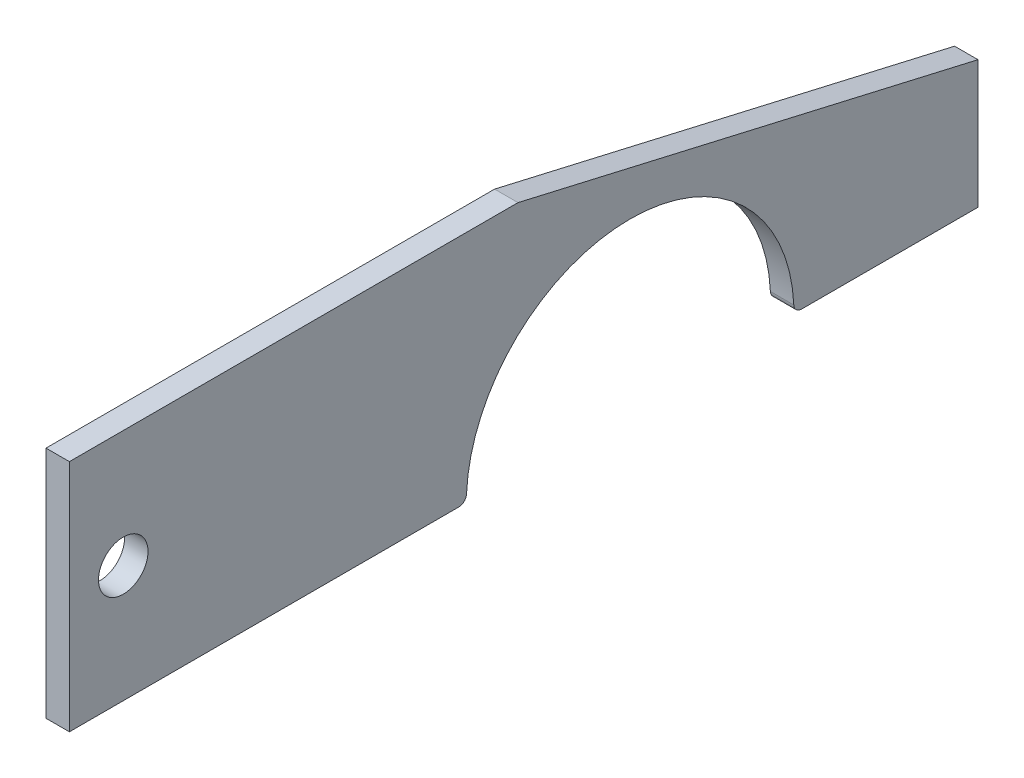
ISO-10303-21;
HEADER;
FILE_DESCRIPTION(('STEP AP214'),'2;1');
FILE_NAME('part.step','',(''),(''),'','','');
FILE_SCHEMA(('AUTOMOTIVE_DESIGN { 1 0 10303 214 1 1 1 1 }'));
ENDSEC;
DATA;
#1=APPLICATION_CONTEXT('core data for automotive mechanical design processes');
#2=APPLICATION_PROTOCOL_DEFINITION('international standard','automotive_design',2000,#1);
#3=PRODUCT_CONTEXT('',#1,'mechanical');
#4=PRODUCT('Part','Part','',(#3));
#5=PRODUCT_RELATED_PRODUCT_CATEGORY('part','',(#4));
#6=PRODUCT_DEFINITION_FORMATION('','',#4);
#7=PRODUCT_DEFINITION_CONTEXT('part definition',#1,'design');
#8=PRODUCT_DEFINITION('design','',#6,#7);
#9=PRODUCT_DEFINITION_SHAPE('','',#8);
#10=(LENGTH_UNIT() NAMED_UNIT(*) SI_UNIT(.MILLI.,.METRE.));
#11=(NAMED_UNIT(*) PLANE_ANGLE_UNIT() SI_UNIT($,.RADIAN.));
#12=(NAMED_UNIT(*) SI_UNIT($,.STERADIAN.) SOLID_ANGLE_UNIT());
#13=UNCERTAINTY_MEASURE_WITH_UNIT(LENGTH_MEASURE(1.E-05),#10,'distance_accuracy_value','');
#14=(GEOMETRIC_REPRESENTATION_CONTEXT(3) GLOBAL_UNCERTAINTY_ASSIGNED_CONTEXT((#13)) GLOBAL_UNIT_ASSIGNED_CONTEXT((#10,
#11,#12)) REPRESENTATION_CONTEXT('',''));
#15=CARTESIAN_POINT('',(0.,0.,0.));
#16=DIRECTION('',(0.,0.,1.));
#17=DIRECTION('',(1.,0.,0.));
#18=AXIS2_PLACEMENT_3D('',#15,#16,#17);
#19=CARTESIAN_POINT('',(3.,-30.,0.));
#20=DIRECTION('',(0.,0.,-1.));
#21=DIRECTION('',(-1.,0.,0.));
#22=AXIS2_PLACEMENT_3D('',#19,#20,#21);
#23=PLANE('',#22);
#24=DIRECTION('',(0.,-1.,0.));
#25=VECTOR('',#24,1.);
#26=CARTESIAN_POINT('',(0.,-30.,0.));
#27=LINE('',#26,#25);
#28=CARTESIAN_POINT('',(0.,0.,0.));
#29=VERTEX_POINT('',#28);
#30=CARTESIAN_POINT('',(0.,-30.,0.));
#31=VERTEX_POINT('',#30);
#32=EDGE_CURVE('E128',#29,#31,#27,.T.);
#33=ORIENTED_EDGE('',*,*,#32,.T.);
#34=DIRECTION('',(-1.,0.,0.));
#35=VECTOR('',#34,1.);
#36=CARTESIAN_POINT('',(3.,-30.,0.));
#37=LINE('',#36,#35);
#38=CARTESIAN_POINT('',(3.,-30.,0.));
#39=VERTEX_POINT('',#38);
#40=EDGE_CURVE('E111',#39,#31,#37,.T.);
#41=ORIENTED_EDGE('',*,*,#40,.F.);
#42=DIRECTION('',(0.,-1.,0.));
#43=VECTOR('',#42,1.);
#44=CARTESIAN_POINT('',(3.,-30.,0.));
#45=LINE('',#44,#43);
#46=CARTESIAN_POINT('',(3.,0.,0.));
#47=VERTEX_POINT('',#46);
#48=EDGE_CURVE('E120',#47,#39,#45,.T.);
#49=ORIENTED_EDGE('',*,*,#48,.F.);
#50=DIRECTION('',(-1.,0.,0.));
#51=VECTOR('',#50,1.);
#52=CARTESIAN_POINT('',(3.,0.,0.));
#53=LINE('',#52,#51);
#54=EDGE_CURVE('E178',#47,#29,#53,.T.);
#55=ORIENTED_EDGE('',*,*,#54,.T.);
#56=EDGE_LOOP('',(#33,#41,#49,#55));
#57=FACE_BOUND('',#56,.T.);
#58=ADVANCED_FACE('F39',(#57),#23,.F.);
#59=CARTESIAN_POINT('',(3.,-30.,-50.8832460315991));
#60=DIRECTION('',(0.,1.,0.));
#61=DIRECTION('',(0.,0.,1.));
#62=AXIS2_PLACEMENT_3D('',#59,#60,#61);
#63=PLANE('',#62);
#64=DIRECTION('',(0.,0.,-1.));
#65=VECTOR('',#64,1.);
#66=CARTESIAN_POINT('',(0.,-30.,-50.8832460315991));
#67=LINE('',#66,#65);
#68=CARTESIAN_POINT('',(0.,-30.,-49.9059850557632));
#69=VERTEX_POINT('',#68);
#70=EDGE_CURVE('E161',#31,#69,#67,.T.);
#71=ORIENTED_EDGE('',*,*,#70,.T.);
#72=DIRECTION('',(-1.,0.,0.));
#73=VECTOR('',#72,1.);
#74=CARTESIAN_POINT('',(3.,-30.,-49.9059850557632));
#75=LINE('',#74,#73);
#76=CARTESIAN_POINT('',(3.,-30.,-49.9059850557632));
#77=VERTEX_POINT('',#76);
#78=EDGE_CURVE('E64',#69,#77,#75,.F.);
#79=ORIENTED_EDGE('',*,*,#78,.T.);
#80=DIRECTION('',(0.,0.,-1.));
#81=VECTOR('',#80,1.);
#82=CARTESIAN_POINT('',(3.,-30.,-50.8832460315991));
#83=LINE('',#82,#81);
#84=EDGE_CURVE('E109',#39,#77,#83,.T.);
#85=ORIENTED_EDGE('',*,*,#84,.F.);
#86=ORIENTED_EDGE('',*,*,#40,.T.);
#87=EDGE_LOOP('',(#71,#79,#85,#86));
#88=FACE_BOUND('',#87,.T.);
#89=ADVANCED_FACE('F115',(#88),#63,.F.);
#90=CARTESIAN_POINT('',(3.,-30.,-71.8832460315991));
#91=DIRECTION('',(-1.,0.,0.));
#92=DIRECTION('',(0.,0.,1.));
#93=AXIS2_PLACEMENT_3D('',#90,#91,#92);
#94=CYLINDRICAL_SURFACE('',#93,21.);
#95=CARTESIAN_POINT('',(3.,-30.,-71.8832460315991));
#96=DIRECTION('',(-1.,0.,0.));
#97=DIRECTION('',(0.,0.,1.));
#98=AXIS2_PLACEMENT_3D('',#95,#96,#97);
#99=CIRCLE('',#98,21.);
#100=CARTESIAN_POINT('',(3.,-29.0454545454545,-50.9049514637557));
#101=VERTEX_POINT('',#100);
#102=CARTESIAN_POINT('',(3.,-29.0454545454545,-92.8615405994424));
#103=VERTEX_POINT('',#102);
#104=EDGE_CURVE('E119',#101,#103,#99,.T.);
#105=ORIENTED_EDGE('',*,*,#104,.F.);
#106=DIRECTION('',(-1.,0.,0.));
#107=VECTOR('',#106,1.);
#108=CARTESIAN_POINT('',(3.,-29.0454545454545,-50.9049514637557));
#109=LINE('',#108,#107);
#110=CARTESIAN_POINT('',(0.,-29.0454545454545,-50.9049514637557));
#111=VERTEX_POINT('',#110);
#112=EDGE_CURVE('E131',#101,#111,#109,.T.);
#113=ORIENTED_EDGE('',*,*,#112,.T.);
#114=CARTESIAN_POINT('',(0.,-30.,-71.8832460315991));
#115=DIRECTION('',(-1.,0.,0.));
#116=DIRECTION('',(0.,0.,1.));
#117=AXIS2_PLACEMENT_3D('',#114,#115,#116);
#118=CIRCLE('',#117,21.);
#119=CARTESIAN_POINT('',(0.,-29.0454545454545,-92.8615405994424));
#120=VERTEX_POINT('',#119);
#121=EDGE_CURVE('E165',#111,#120,#118,.T.);
#122=ORIENTED_EDGE('',*,*,#121,.T.);
#123=DIRECTION('',(-1.,0.,0.));
#124=VECTOR('',#123,1.);
#125=CARTESIAN_POINT('',(3.,-29.0454545454545,-92.8615405994424));
#126=LINE('',#125,#124);
#127=EDGE_CURVE('E132',#120,#103,#126,.F.);
#128=ORIENTED_EDGE('',*,*,#127,.T.);
#129=EDGE_LOOP('',(#105,#113,#122,#128));
#130=FACE_BOUND('',#129,.T.);
#131=ADVANCED_FACE('F155',(#130),#94,.F.);
#132=CARTESIAN_POINT('',(3.,-30.,-116.474786714868));
#133=DIRECTION('',(0.,1.,0.));
#134=DIRECTION('',(0.,0.,1.));
#135=AXIS2_PLACEMENT_3D('',#132,#133,#134);
#136=PLANE('',#135);
#137=DIRECTION('',(0.,0.,-1.));
#138=VECTOR('',#137,1.);
#139=CARTESIAN_POINT('',(3.,-30.,-116.474786714868));
#140=LINE('',#139,#138);
#141=CARTESIAN_POINT('',(3.,-30.,-93.860507007435));
#142=VERTEX_POINT('',#141);
#143=CARTESIAN_POINT('',(3.,-30.,-116.474786714868));
#144=VERTEX_POINT('',#143);
#145=EDGE_CURVE('E156',#142,#144,#140,.T.);
#146=ORIENTED_EDGE('',*,*,#145,.F.);
#147=DIRECTION('',(-1.,0.,0.));
#148=VECTOR('',#147,1.);
#149=CARTESIAN_POINT('',(3.,-30.,-93.860507007435));
#150=LINE('',#149,#148);
#151=CARTESIAN_POINT('',(0.,-30.,-93.860507007435));
#152=VERTEX_POINT('',#151);
#153=EDGE_CURVE('E11',#142,#152,#150,.T.);
#154=ORIENTED_EDGE('',*,*,#153,.T.);
#155=DIRECTION('',(0.,0.,-1.));
#156=VECTOR('',#155,1.);
#157=CARTESIAN_POINT('',(0.,-30.,-116.474786714868));
#158=LINE('',#157,#156);
#159=CARTESIAN_POINT('',(0.,-30.,-116.474786714868));
#160=VERTEX_POINT('',#159);
#161=EDGE_CURVE('E163',#152,#160,#158,.T.);
#162=ORIENTED_EDGE('',*,*,#161,.T.);
#163=DIRECTION('',(-1.,0.,0.));
#164=VECTOR('',#163,1.);
#165=CARTESIAN_POINT('',(3.,-30.,-116.474786714868));
#166=LINE('',#165,#164);
#167=EDGE_CURVE('E134',#144,#160,#166,.T.);
#168=ORIENTED_EDGE('',*,*,#167,.F.);
#169=EDGE_LOOP('',(#146,#154,#162,#168));
#170=FACE_BOUND('',#169,.T.);
#171=ADVANCED_FACE('F239',(#170),#136,.F.);
#172=CARTESIAN_POINT('',(3.,-30.,-116.474786714868));
#173=DIRECTION('',(0.,0.,1.));
#174=DIRECTION('',(1.,0.,0.));
#175=AXIS2_PLACEMENT_3D('',#172,#173,#174);
#176=PLANE('',#175);
#177=DIRECTION('',(0.,1.,0.));
#178=VECTOR('',#177,1.);
#179=CARTESIAN_POINT('',(0.,-30.,-116.474786714868));
#180=LINE('',#179,#178);
#181=CARTESIAN_POINT('',(0.,-13.6150811654936,-116.474786714868));
#182=VERTEX_POINT('',#181);
#183=EDGE_CURVE('E172',#160,#182,#180,.T.);
#184=ORIENTED_EDGE('',*,*,#183,.T.);
#185=DIRECTION('',(-1.,0.,0.));
#186=VECTOR('',#185,1.);
#187=CARTESIAN_POINT('',(3.,-13.6150811654936,-116.474786714868));
#188=LINE('',#187,#186);
#189=CARTESIAN_POINT('',(3.,-13.6150811654936,-116.474786714868));
#190=VERTEX_POINT('',#189);
#191=EDGE_CURVE('E140',#190,#182,#188,.T.);
#192=ORIENTED_EDGE('',*,*,#191,.F.);
#193=DIRECTION('',(0.,1.,0.));
#194=VECTOR('',#193,1.);
#195=CARTESIAN_POINT('',(3.,-30.,-116.474786714868));
#196=LINE('',#195,#194);
#197=EDGE_CURVE('E194',#144,#190,#196,.T.);
#198=ORIENTED_EDGE('',*,*,#197,.F.);
#199=ORIENTED_EDGE('',*,*,#167,.T.);
#200=EDGE_LOOP('',(#184,#192,#198,#199));
#201=FACE_BOUND('',#200,.T.);
#202=ADVANCED_FACE('F242',(#201),#176,.F.);
#203=CARTESIAN_POINT('',(3.,-13.6150811654936,-116.474786714868));
#204=DIRECTION('',(0.,-0.974367820011399,0.224960777306255));
#205=DIRECTION('',(0.,-0.224960777306255,-0.974367820011399));
#206=AXIS2_PLACEMENT_3D('',#203,#204,#205);
#207=PLANE('',#206);
#208=DIRECTION('',(0.,0.224960777306255,0.974367820011399));
#209=VECTOR('',#208,1.);
#210=CARTESIAN_POINT('',(0.,-13.6150811654936,-116.474786714868));
#211=LINE('',#210,#209);
#212=CARTESIAN_POINT('',(0.,0.,-57.5040758498346));
#213=VERTEX_POINT('',#212);
#214=EDGE_CURVE('E175',#182,#213,#211,.T.);
#215=ORIENTED_EDGE('',*,*,#214,.T.);
#216=DIRECTION('',(-1.,0.,0.));
#217=VECTOR('',#216,1.);
#218=CARTESIAN_POINT('',(3.,0.,-57.5040758498346));
#219=LINE('',#218,#217);
#220=CARTESIAN_POINT('',(3.,0.,-57.5040758498346));
#221=VERTEX_POINT('',#220);
#222=EDGE_CURVE('E176',#221,#213,#219,.T.);
#223=ORIENTED_EDGE('',*,*,#222,.F.);
#224=DIRECTION('',(0.,0.224960777306255,0.974367820011399));
#225=VECTOR('',#224,1.);
#226=CARTESIAN_POINT('',(3.,-13.6150811654936,-116.474786714868));
#227=LINE('',#226,#225);
#228=EDGE_CURVE('E189',#190,#221,#227,.T.);
#229=ORIENTED_EDGE('',*,*,#228,.F.);
#230=ORIENTED_EDGE('',*,*,#191,.T.);
#231=EDGE_LOOP('',(#215,#223,#229,#230));
#232=FACE_BOUND('',#231,.T.);
#233=ADVANCED_FACE('F183',(#232),#207,.F.);
#234=CARTESIAN_POINT('',(3.,0.,0.));
#235=DIRECTION('',(0.,-1.,0.));
#236=DIRECTION('',(0.,0.,-1.));
#237=AXIS2_PLACEMENT_3D('',#234,#235,#236);
#238=PLANE('',#237);
#239=DIRECTION('',(0.,0.,1.));
#240=VECTOR('',#239,1.);
#241=CARTESIAN_POINT('',(0.,0.,0.));
#242=LINE('',#241,#240);
#243=EDGE_CURVE('E130',#213,#29,#242,.T.);
#244=ORIENTED_EDGE('',*,*,#243,.T.);
#245=ORIENTED_EDGE('',*,*,#54,.F.);
#246=DIRECTION('',(0.,0.,1.));
#247=VECTOR('',#246,1.);
#248=CARTESIAN_POINT('',(3.,0.,0.));
#249=LINE('',#248,#247);
#250=EDGE_CURVE('E121',#221,#47,#249,.T.);
#251=ORIENTED_EDGE('',*,*,#250,.F.);
#252=ORIENTED_EDGE('',*,*,#222,.T.);
#253=EDGE_LOOP('',(#244,#245,#251,#252));
#254=FACE_BOUND('',#253,.T.);
#255=ADVANCED_FACE('F192',(#254),#238,.F.);
#256=CARTESIAN_POINT('',(3.,-30.,-71.8832460315991));
#257=DIRECTION('',(-1.,0.,0.));
#258=DIRECTION('',(0.,0.,1.));
#259=AXIS2_PLACEMENT_3D('',#256,#257,#258);
#260=PLANE('',#259);
#261=CARTESIAN_POINT('',(3.,-15.,-6.90090396196297));
#262=DIRECTION('',(1.,0.,0.));
#263=DIRECTION('',(0.,0.,-1.));
#264=AXIS2_PLACEMENT_3D('',#261,#262,#263);
#265=CIRCLE('',#264,3.175);
#266=CARTESIAN_POINT('',(3.,-15.,-10.075903961963));
#267=VERTEX_POINT('',#266);
#268=EDGE_CURVE('E199',#267,#267,#265,.T.);
#269=ORIENTED_EDGE('',*,*,#268,.F.);
#270=EDGE_LOOP('',(#269));
#271=FACE_BOUND('',#270,.T.);
#272=ORIENTED_EDGE('',*,*,#84,.T.);
#273=CARTESIAN_POINT('',(3.,-29.,-49.9059850557632));
#274=DIRECTION('',(-1.,0.,0.));
#275=DIRECTION('',(0.,0.,1.));
#276=AXIS2_PLACEMENT_3D('',#273,#274,#275);
#277=CIRCLE('',#276,1.);
#278=EDGE_CURVE('E50',#77,#101,#277,.F.);
#279=ORIENTED_EDGE('',*,*,#278,.T.);
#280=ORIENTED_EDGE('',*,*,#104,.T.);
#281=CARTESIAN_POINT('',(3.,-29.,-93.860507007435));
#282=DIRECTION('',(-1.,0.,0.));
#283=DIRECTION('',(0.,0.,1.));
#284=AXIS2_PLACEMENT_3D('',#281,#282,#283);
#285=CIRCLE('',#284,1.);
#286=EDGE_CURVE('E53',#103,#142,#285,.F.);
#287=ORIENTED_EDGE('',*,*,#286,.T.);
#288=ORIENTED_EDGE('',*,*,#145,.T.);
#289=ORIENTED_EDGE('',*,*,#197,.T.);
#290=ORIENTED_EDGE('',*,*,#228,.T.);
#291=ORIENTED_EDGE('',*,*,#250,.T.);
#292=ORIENTED_EDGE('',*,*,#48,.T.);
#293=EDGE_LOOP('',(#272,#279,#280,#287,#288,#289,#290,#291,#292));
#294=FACE_BOUND('',#293,.T.);
#295=ADVANCED_FACE('F123',(#271,#294),#260,.F.);
#296=CARTESIAN_POINT('',(0.,-30.,-71.8832460315991));
#297=DIRECTION('',(-1.,0.,0.));
#298=DIRECTION('',(0.,0.,1.));
#299=AXIS2_PLACEMENT_3D('',#296,#297,#298);
#300=PLANE('',#299);
#301=CARTESIAN_POINT('',(0.,-15.,-6.90090396196297));
#302=DIRECTION('',(1.,0.,0.));
#303=DIRECTION('',(0.,0.,-1.));
#304=AXIS2_PLACEMENT_3D('',#301,#302,#303);
#305=CIRCLE('',#304,3.175);
#306=CARTESIAN_POINT('',(0.,-15.,-10.075903961963));
#307=VERTEX_POINT('',#306);
#308=EDGE_CURVE('E167',#307,#307,#305,.T.);
#309=ORIENTED_EDGE('',*,*,#308,.T.);
#310=EDGE_LOOP('',(#309));
#311=FACE_BOUND('',#310,.T.);
#312=ORIENTED_EDGE('',*,*,#121,.F.);
#313=CARTESIAN_POINT('',(0.,-29.,-49.9059850557632));
#314=DIRECTION('',(-1.,0.,0.));
#315=DIRECTION('',(0.,0.,1.));
#316=AXIS2_PLACEMENT_3D('',#313,#314,#315);
#317=CIRCLE('',#316,1.);
#318=EDGE_CURVE('E144',#111,#69,#317,.T.);
#319=ORIENTED_EDGE('',*,*,#318,.T.);
#320=ORIENTED_EDGE('',*,*,#70,.F.);
#321=ORIENTED_EDGE('',*,*,#32,.F.);
#322=ORIENTED_EDGE('',*,*,#243,.F.);
#323=ORIENTED_EDGE('',*,*,#214,.F.);
#324=ORIENTED_EDGE('',*,*,#183,.F.);
#325=ORIENTED_EDGE('',*,*,#161,.F.);
#326=CARTESIAN_POINT('',(0.,-29.,-93.860507007435));
#327=DIRECTION('',(-1.,0.,0.));
#328=DIRECTION('',(0.,0.,1.));
#329=AXIS2_PLACEMENT_3D('',#326,#327,#328);
#330=CIRCLE('',#329,1.);
#331=EDGE_CURVE('E141',#152,#120,#330,.T.);
#332=ORIENTED_EDGE('',*,*,#331,.T.);
#333=EDGE_LOOP('',(#312,#319,#320,#321,#322,#323,#324,#325,#332));
#334=FACE_BOUND('',#333,.T.);
#335=ADVANCED_FACE('F159',(#311,#334),#300,.T.);
#336=CARTESIAN_POINT('',(0.,-15.,-6.90090396196297));
#337=DIRECTION('',(1.,0.,0.));
#338=DIRECTION('',(0.,0.,-1.));
#339=AXIS2_PLACEMENT_3D('',#336,#337,#338);
#340=CYLINDRICAL_SURFACE('',#339,3.175);
#341=ORIENTED_EDGE('',*,*,#308,.F.);
#342=EDGE_LOOP('',(#341));
#343=FACE_BOUND('',#342,.T.);
#344=ORIENTED_EDGE('',*,*,#268,.T.);
#345=EDGE_LOOP('',(#344));
#346=FACE_BOUND('',#345,.T.);
#347=ADVANCED_FACE('F210',(#343,#346),#340,.F.);
#348=CARTESIAN_POINT('',(3.,-29.,-49.9059850557632));
#349=DIRECTION('',(-1.,0.,0.));
#350=DIRECTION('',(0.,0.,1.));
#351=AXIS2_PLACEMENT_3D('',#348,#349,#350);
#352=CYLINDRICAL_SURFACE('',#351,1.);
#353=ORIENTED_EDGE('',*,*,#278,.F.);
#354=ORIENTED_EDGE('',*,*,#78,.F.);
#355=ORIENTED_EDGE('',*,*,#318,.F.);
#356=ORIENTED_EDGE('',*,*,#112,.F.);
#357=EDGE_LOOP('',(#353,#354,#355,#356));
#358=FACE_BOUND('',#357,.T.);
#359=ADVANCED_FACE('F158',(#358),#352,.T.);
#360=CARTESIAN_POINT('',(3.,-29.,-93.860507007435));
#361=DIRECTION('',(-1.,0.,0.));
#362=DIRECTION('',(0.,0.,1.));
#363=AXIS2_PLACEMENT_3D('',#360,#361,#362);
#364=CYLINDRICAL_SURFACE('',#363,1.);
#365=ORIENTED_EDGE('',*,*,#286,.F.);
#366=ORIENTED_EDGE('',*,*,#127,.F.);
#367=ORIENTED_EDGE('',*,*,#331,.F.);
#368=ORIENTED_EDGE('',*,*,#153,.F.);
#369=EDGE_LOOP('',(#365,#366,#367,#368));
#370=FACE_BOUND('',#369,.T.);
#371=ADVANCED_FACE('F41',(#370),#364,.T.);
#372=CLOSED_SHELL('',(#58,#89,#131,#171,#202,#233,#255,#295,#335,#347,#359,#371));
#373=MANIFOLD_SOLID_BREP('B2',#372);
#374=ADVANCED_BREP_SHAPE_REPRESENTATION('',(#18,#373),#14);
#375=SHAPE_DEFINITION_REPRESENTATION(#9,#374);
ENDSEC;
END-ISO-10303-21;
